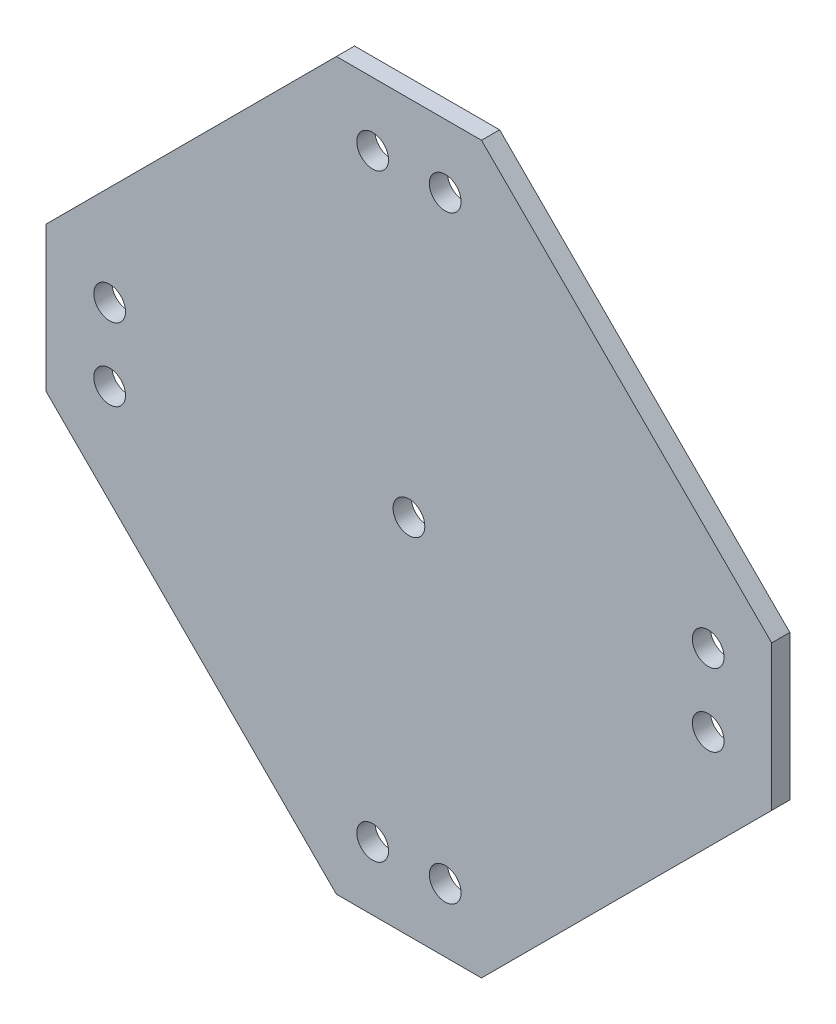
ISO-10303-21;
HEADER;
FILE_DESCRIPTION(('STEP AP214'),'2;1');
FILE_NAME('part.step','',(''),(''),'','','');
FILE_SCHEMA(('AUTOMOTIVE_DESIGN { 1 0 10303 214 1 1 1 1 }'));
ENDSEC;
DATA;
#1=APPLICATION_CONTEXT('core data for automotive mechanical design processes');
#2=APPLICATION_PROTOCOL_DEFINITION('international standard','automotive_design',2000,#1);
#3=PRODUCT_CONTEXT('',#1,'mechanical');
#4=PRODUCT('Part','Part','',(#3));
#5=PRODUCT_RELATED_PRODUCT_CATEGORY('part','',(#4));
#6=PRODUCT_DEFINITION_FORMATION('','',#4);
#7=PRODUCT_DEFINITION_CONTEXT('part definition',#1,'design');
#8=PRODUCT_DEFINITION('design','',#6,#7);
#9=PRODUCT_DEFINITION_SHAPE('','',#8);
#10=(LENGTH_UNIT() NAMED_UNIT(*) SI_UNIT(.MILLI.,.METRE.));
#11=(NAMED_UNIT(*) PLANE_ANGLE_UNIT() SI_UNIT($,.RADIAN.));
#12=(NAMED_UNIT(*) SI_UNIT($,.STERADIAN.) SOLID_ANGLE_UNIT());
#13=UNCERTAINTY_MEASURE_WITH_UNIT(LENGTH_MEASURE(1.E-05),#10,'distance_accuracy_value','');
#14=(GEOMETRIC_REPRESENTATION_CONTEXT(3) GLOBAL_UNCERTAINTY_ASSIGNED_CONTEXT((#13)) GLOBAL_UNIT_ASSIGNED_CONTEXT((#10,
#11,#12)) REPRESENTATION_CONTEXT('',''));
#15=CARTESIAN_POINT('',(0.,0.,0.));
#16=DIRECTION('',(0.,0.,1.));
#17=DIRECTION('',(1.,0.,0.));
#18=AXIS2_PLACEMENT_3D('',#15,#16,#17);
#19=CARTESIAN_POINT('',(-40.,8.,2.));
#20=DIRECTION('',(0.707106781186547,-0.707106781186547,0.));
#21=DIRECTION('',(0.707106781186548,0.707106781186548,0.));
#22=AXIS2_PLACEMENT_3D('',#19,#20,#21);
#23=PLANE('',#22);
#24=DIRECTION('',(-0.707106781186548,-0.707106781186548,0.));
#25=VECTOR('',#24,1.);
#26=CARTESIAN_POINT('',(-40.,8.,0.));
#27=LINE('',#26,#25);
#28=CARTESIAN_POINT('',(-8.,40.,0.));
#29=VERTEX_POINT('',#28);
#30=CARTESIAN_POINT('',(-40.,8.,0.));
#31=VERTEX_POINT('',#30);
#32=EDGE_CURVE('E143',#29,#31,#27,.T.);
#33=ORIENTED_EDGE('',*,*,#32,.T.);
#34=DIRECTION('',(0.,0.,-1.));
#35=VECTOR('',#34,1.);
#36=CARTESIAN_POINT('',(-40.,8.,2.));
#37=LINE('',#36,#35);
#38=CARTESIAN_POINT('',(-40.,8.,2.));
#39=VERTEX_POINT('',#38);
#40=EDGE_CURVE('E11',#39,#31,#37,.T.);
#41=ORIENTED_EDGE('',*,*,#40,.F.);
#42=DIRECTION('',(-0.707106781186548,-0.707106781186548,0.));
#43=VECTOR('',#42,1.);
#44=CARTESIAN_POINT('',(-40.,8.,2.));
#45=LINE('',#44,#43);
#46=CARTESIAN_POINT('',(-8.,40.,2.));
#47=VERTEX_POINT('',#46);
#48=EDGE_CURVE('E166',#47,#39,#45,.T.);
#49=ORIENTED_EDGE('',*,*,#48,.F.);
#50=DIRECTION('',(0.,0.,-1.));
#51=VECTOR('',#50,1.);
#52=CARTESIAN_POINT('',(-8.,40.,2.));
#53=LINE('',#52,#51);
#54=EDGE_CURVE('E139',#47,#29,#53,.T.);
#55=ORIENTED_EDGE('',*,*,#54,.T.);
#56=EDGE_LOOP('',(#33,#41,#49,#55));
#57=FACE_BOUND('',#56,.T.);
#58=ADVANCED_FACE('F42',(#57),#23,.F.);
#59=CARTESIAN_POINT('',(-40.,-8.,2.));
#60=DIRECTION('',(1.,0.,0.));
#61=DIRECTION('',(0.,0.,-1.));
#62=AXIS2_PLACEMENT_3D('',#59,#60,#61);
#63=PLANE('',#62);
#64=DIRECTION('',(0.,-1.,0.));
#65=VECTOR('',#64,1.);
#66=CARTESIAN_POINT('',(-40.,-8.,0.));
#67=LINE('',#66,#65);
#68=CARTESIAN_POINT('',(-40.,-8.,0.));
#69=VERTEX_POINT('',#68);
#70=EDGE_CURVE('E147',#31,#69,#67,.T.);
#71=ORIENTED_EDGE('',*,*,#70,.T.);
#72=DIRECTION('',(0.,0.,-1.));
#73=VECTOR('',#72,1.);
#74=CARTESIAN_POINT('',(-40.,-8.,2.));
#75=LINE('',#74,#73);
#76=CARTESIAN_POINT('',(-40.,-8.,2.));
#77=VERTEX_POINT('',#76);
#78=EDGE_CURVE('E51',#77,#69,#75,.T.);
#79=ORIENTED_EDGE('',*,*,#78,.F.);
#80=DIRECTION('',(0.,-1.,0.));
#81=VECTOR('',#80,1.);
#82=CARTESIAN_POINT('',(-40.,-8.,2.));
#83=LINE('',#82,#81);
#84=EDGE_CURVE('E102',#39,#77,#83,.T.);
#85=ORIENTED_EDGE('',*,*,#84,.F.);
#86=ORIENTED_EDGE('',*,*,#40,.T.);
#87=EDGE_LOOP('',(#71,#79,#85,#86));
#88=FACE_BOUND('',#87,.T.);
#89=ADVANCED_FACE('F324',(#88),#63,.F.);
#90=CARTESIAN_POINT('',(-8.,-40.,2.));
#91=DIRECTION('',(0.707106781186547,0.707106781186547,0.));
#92=DIRECTION('',(-0.707106781186548,0.707106781186548,0.));
#93=AXIS2_PLACEMENT_3D('',#90,#91,#92);
#94=PLANE('',#93);
#95=DIRECTION('',(0.707106781186548,-0.707106781186548,0.));
#96=VECTOR('',#95,1.);
#97=CARTESIAN_POINT('',(-8.,-40.,0.));
#98=LINE('',#97,#96);
#99=CARTESIAN_POINT('',(-8.,-40.,0.));
#100=VERTEX_POINT('',#99);
#101=EDGE_CURVE('E151',#69,#100,#98,.T.);
#102=ORIENTED_EDGE('',*,*,#101,.T.);
#103=DIRECTION('',(0.,0.,-1.));
#104=VECTOR('',#103,1.);
#105=CARTESIAN_POINT('',(-8.,-40.,2.));
#106=LINE('',#105,#104);
#107=CARTESIAN_POINT('',(-8.,-40.,2.));
#108=VERTEX_POINT('',#107);
#109=EDGE_CURVE('E177',#108,#100,#106,.T.);
#110=ORIENTED_EDGE('',*,*,#109,.F.);
#111=DIRECTION('',(0.707106781186548,-0.707106781186548,0.));
#112=VECTOR('',#111,1.);
#113=CARTESIAN_POINT('',(-8.,-40.,2.));
#114=LINE('',#113,#112);
#115=EDGE_CURVE('E187',#77,#108,#114,.T.);
#116=ORIENTED_EDGE('',*,*,#115,.F.);
#117=ORIENTED_EDGE('',*,*,#78,.T.);
#118=EDGE_LOOP('',(#102,#110,#116,#117));
#119=FACE_BOUND('',#118,.T.);
#120=ADVANCED_FACE('F185',(#119),#94,.F.);
#121=CARTESIAN_POINT('',(8.,-40.,2.));
#122=DIRECTION('',(0.,1.,0.));
#123=DIRECTION('',(-1.,0.,0.));
#124=AXIS2_PLACEMENT_3D('',#121,#122,#123);
#125=PLANE('',#124);
#126=DIRECTION('',(1.,0.,0.));
#127=VECTOR('',#126,1.);
#128=CARTESIAN_POINT('',(8.,-40.,0.));
#129=LINE('',#128,#127);
#130=CARTESIAN_POINT('',(8.,-40.,0.));
#131=VERTEX_POINT('',#130);
#132=EDGE_CURVE('E154',#100,#131,#129,.T.);
#133=ORIENTED_EDGE('',*,*,#132,.T.);
#134=DIRECTION('',(0.,0.,-1.));
#135=VECTOR('',#134,1.);
#136=CARTESIAN_POINT('',(8.,-40.,2.));
#137=LINE('',#136,#135);
#138=CARTESIAN_POINT('',(8.,-40.,2.));
#139=VERTEX_POINT('',#138);
#140=EDGE_CURVE('E173',#139,#131,#137,.T.);
#141=ORIENTED_EDGE('',*,*,#140,.F.);
#142=DIRECTION('',(1.,0.,0.));
#143=VECTOR('',#142,1.);
#144=CARTESIAN_POINT('',(8.,-40.,2.));
#145=LINE('',#144,#143);
#146=EDGE_CURVE('E200',#108,#139,#145,.T.);
#147=ORIENTED_EDGE('',*,*,#146,.F.);
#148=ORIENTED_EDGE('',*,*,#109,.T.);
#149=EDGE_LOOP('',(#133,#141,#147,#148));
#150=FACE_BOUND('',#149,.T.);
#151=ADVANCED_FACE('F195',(#150),#125,.F.);
#152=CARTESIAN_POINT('',(40.,-8.00000000000001,2.));
#153=DIRECTION('',(-0.707106781186547,0.707106781186547,0.));
#154=DIRECTION('',(-0.707106781186548,-0.707106781186548,0.));
#155=AXIS2_PLACEMENT_3D('',#152,#153,#154);
#156=PLANE('',#155);
#157=DIRECTION('',(0.707106781186548,0.707106781186548,0.));
#158=VECTOR('',#157,1.);
#159=CARTESIAN_POINT('',(40.,-8.00000000000001,0.));
#160=LINE('',#159,#158);
#161=CARTESIAN_POINT('',(40.,-8.00000000000001,0.));
#162=VERTEX_POINT('',#161);
#163=EDGE_CURVE('E157',#131,#162,#160,.T.);
#164=ORIENTED_EDGE('',*,*,#163,.T.);
#165=DIRECTION('',(0.,0.,-1.));
#166=VECTOR('',#165,1.);
#167=CARTESIAN_POINT('',(40.,-8.00000000000001,2.));
#168=LINE('',#167,#166);
#169=CARTESIAN_POINT('',(40.,-8.00000000000001,2.));
#170=VERTEX_POINT('',#169);
#171=EDGE_CURVE('E132',#170,#162,#168,.T.);
#172=ORIENTED_EDGE('',*,*,#171,.F.);
#173=DIRECTION('',(0.707106781186548,0.707106781186548,0.));
#174=VECTOR('',#173,1.);
#175=CARTESIAN_POINT('',(40.,-8.00000000000001,2.));
#176=LINE('',#175,#174);
#177=EDGE_CURVE('E121',#139,#170,#176,.T.);
#178=ORIENTED_EDGE('',*,*,#177,.F.);
#179=ORIENTED_EDGE('',*,*,#140,.T.);
#180=EDGE_LOOP('',(#164,#172,#178,#179));
#181=FACE_BOUND('',#180,.T.);
#182=ADVANCED_FACE('F198',(#181),#156,.F.);
#183=CARTESIAN_POINT('',(40.,8.00000000000001,2.));
#184=DIRECTION('',(-1.,0.,0.));
#185=DIRECTION('',(0.,0.,1.));
#186=AXIS2_PLACEMENT_3D('',#183,#184,#185);
#187=PLANE('',#186);
#188=DIRECTION('',(0.,1.,0.));
#189=VECTOR('',#188,1.);
#190=CARTESIAN_POINT('',(40.,8.00000000000001,0.));
#191=LINE('',#190,#189);
#192=CARTESIAN_POINT('',(40.,8.00000000000001,0.));
#193=VERTEX_POINT('',#192);
#194=EDGE_CURVE('E130',#162,#193,#191,.T.);
#195=ORIENTED_EDGE('',*,*,#194,.T.);
#196=DIRECTION('',(0.,0.,-1.));
#197=VECTOR('',#196,1.);
#198=CARTESIAN_POINT('',(40.,8.00000000000001,2.));
#199=LINE('',#198,#197);
#200=CARTESIAN_POINT('',(40.,8.00000000000001,2.));
#201=VERTEX_POINT('',#200);
#202=EDGE_CURVE('E127',#201,#193,#199,.T.);
#203=ORIENTED_EDGE('',*,*,#202,.F.);
#204=DIRECTION('',(0.,1.,0.));
#205=VECTOR('',#204,1.);
#206=CARTESIAN_POINT('',(40.,8.00000000000001,2.));
#207=LINE('',#206,#205);
#208=EDGE_CURVE('E115',#170,#201,#207,.T.);
#209=ORIENTED_EDGE('',*,*,#208,.F.);
#210=ORIENTED_EDGE('',*,*,#171,.T.);
#211=EDGE_LOOP('',(#195,#203,#209,#210));
#212=FACE_BOUND('',#211,.T.);
#213=ADVANCED_FACE('F128',(#212),#187,.F.);
#214=CARTESIAN_POINT('',(8.,40.,2.));
#215=DIRECTION('',(-0.707106781186547,-0.707106781186547,0.));
#216=DIRECTION('',(0.707106781186548,-0.707106781186548,0.));
#217=AXIS2_PLACEMENT_3D('',#214,#215,#216);
#218=PLANE('',#217);
#219=DIRECTION('',(-0.707106781186548,0.707106781186548,0.));
#220=VECTOR('',#219,1.);
#221=CARTESIAN_POINT('',(8.,40.,0.));
#222=LINE('',#221,#220);
#223=CARTESIAN_POINT('',(8.,40.,0.));
#224=VERTEX_POINT('',#223);
#225=EDGE_CURVE('E88',#193,#224,#222,.T.);
#226=ORIENTED_EDGE('',*,*,#225,.T.);
#227=DIRECTION('',(0.,0.,-1.));
#228=VECTOR('',#227,1.);
#229=CARTESIAN_POINT('',(8.,40.,2.));
#230=LINE('',#229,#228);
#231=CARTESIAN_POINT('',(8.,40.,2.));
#232=VERTEX_POINT('',#231);
#233=EDGE_CURVE('E133',#232,#224,#230,.T.);
#234=ORIENTED_EDGE('',*,*,#233,.F.);
#235=DIRECTION('',(-0.707106781186548,0.707106781186548,0.));
#236=VECTOR('',#235,1.);
#237=CARTESIAN_POINT('',(8.,40.,2.));
#238=LINE('',#237,#236);
#239=EDGE_CURVE('E119',#201,#232,#238,.T.);
#240=ORIENTED_EDGE('',*,*,#239,.F.);
#241=ORIENTED_EDGE('',*,*,#202,.T.);
#242=EDGE_LOOP('',(#226,#234,#240,#241));
#243=FACE_BOUND('',#242,.T.);
#244=ADVANCED_FACE('F135',(#243),#218,.F.);
#245=CARTESIAN_POINT('',(-8.,40.,2.));
#246=DIRECTION('',(0.,-1.,0.));
#247=DIRECTION('',(1.,0.,0.));
#248=AXIS2_PLACEMENT_3D('',#245,#246,#247);
#249=PLANE('',#248);
#250=DIRECTION('',(-1.,0.,0.));
#251=VECTOR('',#250,1.);
#252=CARTESIAN_POINT('',(-8.,40.,0.));
#253=LINE('',#252,#251);
#254=EDGE_CURVE('E94',#224,#29,#253,.T.);
#255=ORIENTED_EDGE('',*,*,#254,.T.);
#256=ORIENTED_EDGE('',*,*,#54,.F.);
#257=DIRECTION('',(-1.,0.,0.));
#258=VECTOR('',#257,1.);
#259=CARTESIAN_POINT('',(-8.,40.,2.));
#260=LINE('',#259,#258);
#261=EDGE_CURVE('E59',#232,#47,#260,.T.);
#262=ORIENTED_EDGE('',*,*,#261,.F.);
#263=ORIENTED_EDGE('',*,*,#233,.T.);
#264=EDGE_LOOP('',(#255,#256,#262,#263));
#265=FACE_BOUND('',#264,.T.);
#266=ADVANCED_FACE('F294',(#265),#249,.F.);
#267=CARTESIAN_POINT('',(0.,0.,2.));
#268=DIRECTION('',(0.,0.,-1.));
#269=DIRECTION('',(-1.,0.,0.));
#270=AXIS2_PLACEMENT_3D('',#267,#268,#269);
#271=PLANE('',#270);
#272=CARTESIAN_POINT('',(-33.,3.99999999999988,2.));
#273=DIRECTION('',(0.,0.,1.));
#274=DIRECTION('',(0.,1.,0.));
#275=AXIS2_PLACEMENT_3D('',#272,#273,#274);
#276=CIRCLE('',#275,1.75);
#277=CARTESIAN_POINT('',(-33.,5.74999999999989,2.));
#278=VERTEX_POINT('',#277);
#279=EDGE_CURVE('E259',#278,#278,#276,.T.);
#280=ORIENTED_EDGE('',*,*,#279,.F.);
#281=EDGE_LOOP('',(#280));
#282=FACE_BOUND('',#281,.T.);
#283=CARTESIAN_POINT('',(4.,-33.,2.));
#284=DIRECTION('',(0.,0.,1.));
#285=DIRECTION('',(-1.,0.,0.));
#286=AXIS2_PLACEMENT_3D('',#283,#284,#285);
#287=CIRCLE('',#286,1.75);
#288=CARTESIAN_POINT('',(2.25,-33.,2.));
#289=VERTEX_POINT('',#288);
#290=EDGE_CURVE('E251',#289,#289,#287,.T.);
#291=ORIENTED_EDGE('',*,*,#290,.F.);
#292=EDGE_LOOP('',(#291));
#293=FACE_BOUND('',#292,.T.);
#294=CARTESIAN_POINT('',(-4.,-33.,2.));
#295=DIRECTION('',(0.,0.,1.));
#296=DIRECTION('',(-1.,0.,0.));
#297=AXIS2_PLACEMENT_3D('',#294,#295,#296);
#298=CIRCLE('',#297,1.75);
#299=CARTESIAN_POINT('',(-5.75,-33.,2.));
#300=VERTEX_POINT('',#299);
#301=EDGE_CURVE('E242',#300,#300,#298,.T.);
#302=ORIENTED_EDGE('',*,*,#301,.F.);
#303=EDGE_LOOP('',(#302));
#304=FACE_BOUND('',#303,.T.);
#305=CARTESIAN_POINT('',(33.,-3.99999999999965,2.));
#306=DIRECTION('',(0.,0.,1.));
#307=DIRECTION('',(0.,-1.,0.));
#308=AXIS2_PLACEMENT_3D('',#305,#306,#307);
#309=CIRCLE('',#308,1.75);
#310=CARTESIAN_POINT('',(33.0000000000001,-5.74999999999965,2.));
#311=VERTEX_POINT('',#310);
#312=EDGE_CURVE('E274',#311,#311,#309,.T.);
#313=ORIENTED_EDGE('',*,*,#312,.F.);
#314=EDGE_LOOP('',(#313));
#315=FACE_BOUND('',#314,.T.);
#316=CARTESIAN_POINT('',(33.,4.00000000000035,2.));
#317=DIRECTION('',(0.,0.,1.));
#318=DIRECTION('',(0.,-1.,0.));
#319=AXIS2_PLACEMENT_3D('',#316,#317,#318);
#320=CIRCLE('',#319,1.75);
#321=CARTESIAN_POINT('',(33.,2.25000000000035,2.));
#322=VERTEX_POINT('',#321);
#323=EDGE_CURVE('E266',#322,#322,#320,.T.);
#324=ORIENTED_EDGE('',*,*,#323,.F.);
#325=EDGE_LOOP('',(#324));
#326=FACE_BOUND('',#325,.T.);
#327=CARTESIAN_POINT('',(-33.,-4.00000000000012,2.));
#328=DIRECTION('',(0.,0.,1.));
#329=DIRECTION('',(0.,1.,0.));
#330=AXIS2_PLACEMENT_3D('',#327,#328,#329);
#331=CIRCLE('',#330,1.75);
#332=CARTESIAN_POINT('',(-33.,-2.25000000000011,2.));
#333=VERTEX_POINT('',#332);
#334=EDGE_CURVE('E234',#333,#333,#331,.T.);
#335=ORIENTED_EDGE('',*,*,#334,.F.);
#336=EDGE_LOOP('',(#335));
#337=FACE_BOUND('',#336,.T.);
#338=CARTESIAN_POINT('',(-4.,33.,2.));
#339=DIRECTION('',(0.,0.,1.));
#340=DIRECTION('',(1.,0.,0.));
#341=AXIS2_PLACEMENT_3D('',#338,#339,#340);
#342=CIRCLE('',#341,1.75);
#343=CARTESIAN_POINT('',(-2.25,33.,2.));
#344=VERTEX_POINT('',#343);
#345=EDGE_CURVE('E227',#344,#344,#342,.T.);
#346=ORIENTED_EDGE('',*,*,#345,.F.);
#347=EDGE_LOOP('',(#346));
#348=FACE_BOUND('',#347,.T.);
#349=CARTESIAN_POINT('',(4.,33.,2.));
#350=DIRECTION('',(0.,0.,1.));
#351=DIRECTION('',(1.,0.,0.));
#352=AXIS2_PLACEMENT_3D('',#349,#350,#351);
#353=CIRCLE('',#352,1.75);
#354=CARTESIAN_POINT('',(5.75,33.,2.));
#355=VERTEX_POINT('',#354);
#356=EDGE_CURVE('E223',#355,#355,#353,.T.);
#357=ORIENTED_EDGE('',*,*,#356,.F.);
#358=EDGE_LOOP('',(#357));
#359=FACE_BOUND('',#358,.T.);
#360=CARTESIAN_POINT('',(0.,0.,2.));
#361=DIRECTION('',(0.,0.,1.));
#362=DIRECTION('',(1.,0.,0.));
#363=AXIS2_PLACEMENT_3D('',#360,#361,#362);
#364=CIRCLE('',#363,1.75);
#365=CARTESIAN_POINT('',(1.75,0.,2.));
#366=VERTEX_POINT('',#365);
#367=EDGE_CURVE('E214',#366,#366,#364,.T.);
#368=ORIENTED_EDGE('',*,*,#367,.F.);
#369=EDGE_LOOP('',(#368));
#370=FACE_BOUND('',#369,.T.);
#371=ORIENTED_EDGE('',*,*,#48,.T.);
#372=ORIENTED_EDGE('',*,*,#84,.T.);
#373=ORIENTED_EDGE('',*,*,#115,.T.);
#374=ORIENTED_EDGE('',*,*,#146,.T.);
#375=ORIENTED_EDGE('',*,*,#177,.T.);
#376=ORIENTED_EDGE('',*,*,#208,.T.);
#377=ORIENTED_EDGE('',*,*,#239,.T.);
#378=ORIENTED_EDGE('',*,*,#261,.T.);
#379=EDGE_LOOP('',(#371,#372,#373,#374,#375,#376,#377,#378));
#380=FACE_BOUND('',#379,.T.);
#381=ADVANCED_FACE('F117',(#282,#293,#304,#315,#326,#337,#348,#359,#370,#380),#271,.F.);
#382=CARTESIAN_POINT('',(0.,0.,0.));
#383=DIRECTION('',(0.,0.,-1.));
#384=DIRECTION('',(-1.,0.,0.));
#385=AXIS2_PLACEMENT_3D('',#382,#383,#384);
#386=PLANE('',#385);
#387=CARTESIAN_POINT('',(-33.,3.99999999999988,0.));
#388=DIRECTION('',(0.,0.,1.));
#389=DIRECTION('',(0.,1.,0.));
#390=AXIS2_PLACEMENT_3D('',#387,#388,#389);
#391=CIRCLE('',#390,1.75);
#392=CARTESIAN_POINT('',(-33.,5.74999999999989,0.));
#393=VERTEX_POINT('',#392);
#394=EDGE_CURVE('E238',#393,#393,#391,.T.);
#395=ORIENTED_EDGE('',*,*,#394,.T.);
#396=EDGE_LOOP('',(#395));
#397=FACE_BOUND('',#396,.T.);
#398=CARTESIAN_POINT('',(4.,-33.,0.));
#399=DIRECTION('',(0.,0.,1.));
#400=DIRECTION('',(-1.,0.,0.));
#401=AXIS2_PLACEMENT_3D('',#398,#399,#400);
#402=CIRCLE('',#401,1.75);
#403=CARTESIAN_POINT('',(2.25,-33.,0.));
#404=VERTEX_POINT('',#403);
#405=EDGE_CURVE('E255',#404,#404,#402,.T.);
#406=ORIENTED_EDGE('',*,*,#405,.T.);
#407=EDGE_LOOP('',(#406));
#408=FACE_BOUND('',#407,.T.);
#409=CARTESIAN_POINT('',(-4.,-33.,0.));
#410=DIRECTION('',(0.,0.,1.));
#411=DIRECTION('',(-1.,0.,0.));
#412=AXIS2_PLACEMENT_3D('',#409,#410,#411);
#413=CIRCLE('',#412,1.75);
#414=CARTESIAN_POINT('',(-5.75,-33.,0.));
#415=VERTEX_POINT('',#414);
#416=EDGE_CURVE('E246',#415,#415,#413,.T.);
#417=ORIENTED_EDGE('',*,*,#416,.T.);
#418=EDGE_LOOP('',(#417));
#419=FACE_BOUND('',#418,.T.);
#420=CARTESIAN_POINT('',(33.,-3.99999999999965,0.));
#421=DIRECTION('',(0.,0.,1.));
#422=DIRECTION('',(0.,-1.,0.));
#423=AXIS2_PLACEMENT_3D('',#420,#421,#422);
#424=CIRCLE('',#423,1.75);
#425=CARTESIAN_POINT('',(33.0000000000001,-5.74999999999965,0.));
#426=VERTEX_POINT('',#425);
#427=EDGE_CURVE('E270',#426,#426,#424,.T.);
#428=ORIENTED_EDGE('',*,*,#427,.T.);
#429=EDGE_LOOP('',(#428));
#430=FACE_BOUND('',#429,.T.);
#431=CARTESIAN_POINT('',(33.,4.00000000000035,0.));
#432=DIRECTION('',(0.,0.,1.));
#433=DIRECTION('',(0.,-1.,0.));
#434=AXIS2_PLACEMENT_3D('',#431,#432,#433);
#435=CIRCLE('',#434,1.75);
#436=CARTESIAN_POINT('',(33.,2.25000000000035,0.));
#437=VERTEX_POINT('',#436);
#438=EDGE_CURVE('E247',#437,#437,#435,.T.);
#439=ORIENTED_EDGE('',*,*,#438,.T.);
#440=EDGE_LOOP('',(#439));
#441=FACE_BOUND('',#440,.T.);
#442=CARTESIAN_POINT('',(-33.,-4.00000000000012,0.));
#443=DIRECTION('',(0.,0.,1.));
#444=DIRECTION('',(0.,1.,0.));
#445=AXIS2_PLACEMENT_3D('',#442,#443,#444);
#446=CIRCLE('',#445,1.75);
#447=CARTESIAN_POINT('',(-33.,-2.25000000000011,0.));
#448=VERTEX_POINT('',#447);
#449=EDGE_CURVE('E215',#448,#448,#446,.T.);
#450=ORIENTED_EDGE('',*,*,#449,.T.);
#451=EDGE_LOOP('',(#450));
#452=FACE_BOUND('',#451,.T.);
#453=CARTESIAN_POINT('',(-4.,33.,0.));
#454=DIRECTION('',(0.,0.,1.));
#455=DIRECTION('',(1.,0.,0.));
#456=AXIS2_PLACEMENT_3D('',#453,#454,#455);
#457=CIRCLE('',#456,1.75);
#458=CARTESIAN_POINT('',(-2.25,33.,0.));
#459=VERTEX_POINT('',#458);
#460=EDGE_CURVE('E148',#459,#459,#457,.T.);
#461=ORIENTED_EDGE('',*,*,#460,.T.);
#462=EDGE_LOOP('',(#461));
#463=FACE_BOUND('',#462,.T.);
#464=CARTESIAN_POINT('',(4.,33.,0.));
#465=DIRECTION('',(0.,0.,1.));
#466=DIRECTION('',(1.,0.,0.));
#467=AXIS2_PLACEMENT_3D('',#464,#465,#466);
#468=CIRCLE('',#467,1.75);
#469=CARTESIAN_POINT('',(5.75,33.,0.));
#470=VERTEX_POINT('',#469);
#471=EDGE_CURVE('E219',#470,#470,#468,.T.);
#472=ORIENTED_EDGE('',*,*,#471,.T.);
#473=EDGE_LOOP('',(#472));
#474=FACE_BOUND('',#473,.T.);
#475=CARTESIAN_POINT('',(0.,0.,0.));
#476=DIRECTION('',(0.,0.,1.));
#477=DIRECTION('',(1.,0.,0.));
#478=AXIS2_PLACEMENT_3D('',#475,#476,#477);
#479=CIRCLE('',#478,1.75);
#480=CARTESIAN_POINT('',(1.75,0.,0.));
#481=VERTEX_POINT('',#480);
#482=EDGE_CURVE('E210',#481,#481,#479,.T.);
#483=ORIENTED_EDGE('',*,*,#482,.T.);
#484=EDGE_LOOP('',(#483));
#485=FACE_BOUND('',#484,.T.);
#486=ORIENTED_EDGE('',*,*,#32,.F.);
#487=ORIENTED_EDGE('',*,*,#254,.F.);
#488=ORIENTED_EDGE('',*,*,#225,.F.);
#489=ORIENTED_EDGE('',*,*,#194,.F.);
#490=ORIENTED_EDGE('',*,*,#163,.F.);
#491=ORIENTED_EDGE('',*,*,#132,.F.);
#492=ORIENTED_EDGE('',*,*,#101,.F.);
#493=ORIENTED_EDGE('',*,*,#70,.F.);
#494=EDGE_LOOP('',(#486,#487,#488,#489,#490,#491,#492,#493));
#495=FACE_BOUND('',#494,.T.);
#496=ADVANCED_FACE('F191',(#397,#408,#419,#430,#441,#452,#463,#474,#485,#495),#386,.T.);
#497=CARTESIAN_POINT('',(0.,0.,0.));
#498=DIRECTION('',(0.,0.,1.));
#499=DIRECTION('',(1.,0.,0.));
#500=AXIS2_PLACEMENT_3D('',#497,#498,#499);
#501=CYLINDRICAL_SURFACE('',#500,1.75);
#502=ORIENTED_EDGE('',*,*,#482,.F.);
#503=EDGE_LOOP('',(#502));
#504=FACE_BOUND('',#503,.T.);
#505=ORIENTED_EDGE('',*,*,#367,.T.);
#506=EDGE_LOOP('',(#505));
#507=FACE_BOUND('',#506,.T.);
#508=ADVANCED_FACE('F307',(#504,#507),#501,.F.);
#509=CARTESIAN_POINT('',(4.,33.,0.));
#510=DIRECTION('',(0.,0.,1.));
#511=DIRECTION('',(1.,0.,0.));
#512=AXIS2_PLACEMENT_3D('',#509,#510,#511);
#513=CYLINDRICAL_SURFACE('',#512,1.75);
#514=ORIENTED_EDGE('',*,*,#471,.F.);
#515=EDGE_LOOP('',(#514));
#516=FACE_BOUND('',#515,.T.);
#517=ORIENTED_EDGE('',*,*,#356,.T.);
#518=EDGE_LOOP('',(#517));
#519=FACE_BOUND('',#518,.T.);
#520=ADVANCED_FACE('F309',(#516,#519),#513,.F.);
#521=CARTESIAN_POINT('',(-4.,33.,0.));
#522=DIRECTION('',(0.,0.,1.));
#523=DIRECTION('',(1.,0.,0.));
#524=AXIS2_PLACEMENT_3D('',#521,#522,#523);
#525=CYLINDRICAL_SURFACE('',#524,1.75);
#526=ORIENTED_EDGE('',*,*,#460,.F.);
#527=EDGE_LOOP('',(#526));
#528=FACE_BOUND('',#527,.T.);
#529=ORIENTED_EDGE('',*,*,#345,.T.);
#530=EDGE_LOOP('',(#529));
#531=FACE_BOUND('',#530,.T.);
#532=ADVANCED_FACE('F316',(#528,#531),#525,.F.);
#533=CARTESIAN_POINT('',(-33.,-4.00000000000012,0.));
#534=DIRECTION('',(0.,0.,1.));
#535=DIRECTION('',(1.,0.,0.));
#536=AXIS2_PLACEMENT_3D('',#533,#534,#535);
#537=CYLINDRICAL_SURFACE('',#536,1.75);
#538=ORIENTED_EDGE('',*,*,#449,.F.);
#539=EDGE_LOOP('',(#538));
#540=FACE_BOUND('',#539,.T.);
#541=ORIENTED_EDGE('',*,*,#334,.T.);
#542=EDGE_LOOP('',(#541));
#543=FACE_BOUND('',#542,.T.);
#544=ADVANCED_FACE('F394',(#540,#543),#537,.F.);
#545=CARTESIAN_POINT('',(33.,4.00000000000035,0.));
#546=DIRECTION('',(0.,0.,1.));
#547=DIRECTION('',(1.,0.,0.));
#548=AXIS2_PLACEMENT_3D('',#545,#546,#547);
#549=CYLINDRICAL_SURFACE('',#548,1.75);
#550=ORIENTED_EDGE('',*,*,#438,.F.);
#551=EDGE_LOOP('',(#550));
#552=FACE_BOUND('',#551,.T.);
#553=ORIENTED_EDGE('',*,*,#323,.T.);
#554=EDGE_LOOP('',(#553));
#555=FACE_BOUND('',#554,.T.);
#556=ADVANCED_FACE('F288',(#552,#555),#549,.F.);
#557=CARTESIAN_POINT('',(33.,-3.99999999999965,0.));
#558=DIRECTION('',(0.,0.,1.));
#559=DIRECTION('',(1.,0.,0.));
#560=AXIS2_PLACEMENT_3D('',#557,#558,#559);
#561=CYLINDRICAL_SURFACE('',#560,1.75);
#562=ORIENTED_EDGE('',*,*,#427,.F.);
#563=EDGE_LOOP('',(#562));
#564=FACE_BOUND('',#563,.T.);
#565=ORIENTED_EDGE('',*,*,#312,.T.);
#566=EDGE_LOOP('',(#565));
#567=FACE_BOUND('',#566,.T.);
#568=ADVANCED_FACE('F284',(#564,#567),#561,.F.);
#569=CARTESIAN_POINT('',(-4.,-33.,0.));
#570=DIRECTION('',(0.,0.,1.));
#571=DIRECTION('',(1.,0.,0.));
#572=AXIS2_PLACEMENT_3D('',#569,#570,#571);
#573=CYLINDRICAL_SURFACE('',#572,1.75);
#574=ORIENTED_EDGE('',*,*,#416,.F.);
#575=EDGE_LOOP('',(#574));
#576=FACE_BOUND('',#575,.T.);
#577=ORIENTED_EDGE('',*,*,#301,.T.);
#578=EDGE_LOOP('',(#577));
#579=FACE_BOUND('',#578,.T.);
#580=ADVANCED_FACE('F287',(#576,#579),#573,.F.);
#581=CARTESIAN_POINT('',(4.,-33.,0.));
#582=DIRECTION('',(0.,0.,1.));
#583=DIRECTION('',(1.,0.,0.));
#584=AXIS2_PLACEMENT_3D('',#581,#582,#583);
#585=CYLINDRICAL_SURFACE('',#584,1.75);
#586=ORIENTED_EDGE('',*,*,#405,.F.);
#587=EDGE_LOOP('',(#586));
#588=FACE_BOUND('',#587,.T.);
#589=ORIENTED_EDGE('',*,*,#290,.T.);
#590=EDGE_LOOP('',(#589));
#591=FACE_BOUND('',#590,.T.);
#592=ADVANCED_FACE('F437',(#588,#591),#585,.F.);
#593=CARTESIAN_POINT('',(-33.,3.99999999999988,0.));
#594=DIRECTION('',(0.,0.,1.));
#595=DIRECTION('',(1.,0.,0.));
#596=AXIS2_PLACEMENT_3D('',#593,#594,#595);
#597=CYLINDRICAL_SURFACE('',#596,1.75);
#598=ORIENTED_EDGE('',*,*,#394,.F.);
#599=EDGE_LOOP('',(#598));
#600=FACE_BOUND('',#599,.T.);
#601=ORIENTED_EDGE('',*,*,#279,.T.);
#602=EDGE_LOOP('',(#601));
#603=FACE_BOUND('',#602,.T.);
#604=ADVANCED_FACE('F448',(#600,#603),#597,.F.);
#605=CLOSED_SHELL('',(#58,#89,#120,#151,#182,#213,#244,#266,#381,#496,#508,#520,#532,#544,#556,
#568,#580,#592,#604));
#606=MANIFOLD_SOLID_BREP('B2',#605);
#607=ADVANCED_BREP_SHAPE_REPRESENTATION('',(#18,#606),#14);
#608=SHAPE_DEFINITION_REPRESENTATION(#9,#607);
ENDSEC;
END-ISO-10303-21;
